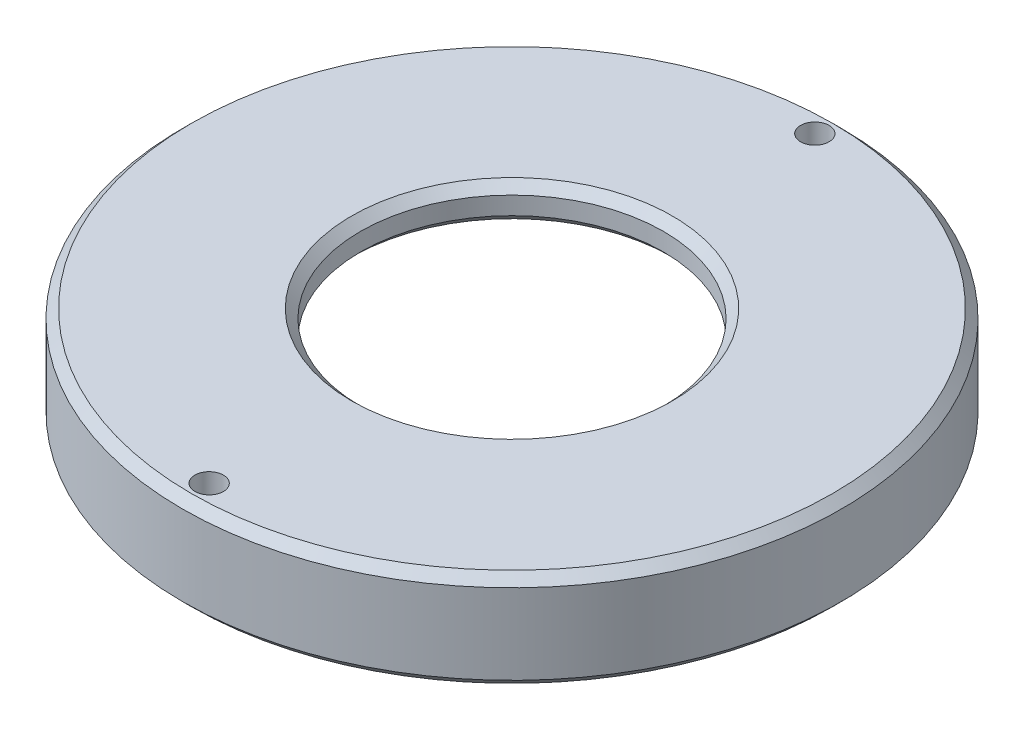
ISO-10303-21;
HEADER;
FILE_DESCRIPTION(('STEP AP214'),'2;1');
FILE_NAME('part.step','',(''),(''),'','','');
FILE_SCHEMA(('AUTOMOTIVE_DESIGN { 1 0 10303 214 1 1 1 1 }'));
ENDSEC;
DATA;
#1=APPLICATION_CONTEXT('core data for automotive mechanical design processes');
#2=APPLICATION_PROTOCOL_DEFINITION('international standard','automotive_design',2000,#1);
#3=PRODUCT_CONTEXT('',#1,'mechanical');
#4=PRODUCT('Part','Part','',(#3));
#5=PRODUCT_RELATED_PRODUCT_CATEGORY('part','',(#4));
#6=PRODUCT_DEFINITION_FORMATION('','',#4);
#7=PRODUCT_DEFINITION_CONTEXT('part definition',#1,'design');
#8=PRODUCT_DEFINITION('design','',#6,#7);
#9=PRODUCT_DEFINITION_SHAPE('','',#8);
#10=(LENGTH_UNIT() NAMED_UNIT(*) SI_UNIT(.MILLI.,.METRE.));
#11=(NAMED_UNIT(*) PLANE_ANGLE_UNIT() SI_UNIT($,.RADIAN.));
#12=(NAMED_UNIT(*) SI_UNIT($,.STERADIAN.) SOLID_ANGLE_UNIT());
#13=UNCERTAINTY_MEASURE_WITH_UNIT(LENGTH_MEASURE(1.E-05),#10,'distance_accuracy_value','');
#14=(GEOMETRIC_REPRESENTATION_CONTEXT(3) GLOBAL_UNCERTAINTY_ASSIGNED_CONTEXT((#13)) GLOBAL_UNIT_ASSIGNED_CONTEXT((#10,
#11,#12)) REPRESENTATION_CONTEXT('',''));
#15=CARTESIAN_POINT('',(0.,0.,0.));
#16=DIRECTION('',(0.,0.,1.));
#17=DIRECTION('',(1.,0.,0.));
#18=AXIS2_PLACEMENT_3D('',#15,#16,#17);
#19=CARTESIAN_POINT('',(0.,0.,0.));
#20=DIRECTION('',(0.,-1.,0.));
#21=DIRECTION('',(0.,0.,-1.));
#22=AXIS2_PLACEMENT_3D('',#19,#20,#21);
#23=CYLINDRICAL_SURFACE('',#22,8.5);
#24=CARTESIAN_POINT('',(0.,1.5,0.));
#25=DIRECTION('',(0.,1.,0.));
#26=DIRECTION('',(0.,0.,1.));
#27=AXIS2_PLACEMENT_3D('',#24,#25,#26);
#28=CIRCLE('',#27,8.5);
#29=CARTESIAN_POINT('',(0.,1.5,8.5));
#30=VERTEX_POINT('',#29);
#31=EDGE_CURVE('E40',#30,#30,#28,.T.);
#32=ORIENTED_EDGE('',*,*,#31,.T.);
#33=EDGE_LOOP('',(#32));
#34=FACE_BOUND('',#33,.T.);
#35=CARTESIAN_POINT('',(0.,0.500000000000007,0.));
#36=DIRECTION('',(0.,-1.,0.));
#37=DIRECTION('',(0.,0.,-1.));
#38=AXIS2_PLACEMENT_3D('',#35,#36,#37);
#39=CIRCLE('',#38,8.5);
#40=CARTESIAN_POINT('',(0.,0.500000000000007,-8.5));
#41=VERTEX_POINT('',#40);
#42=EDGE_CURVE('E44',#41,#41,#39,.T.);
#43=ORIENTED_EDGE('',*,*,#42,.T.);
#44=EDGE_LOOP('',(#43));
#45=FACE_BOUND('',#44,.T.);
#46=ADVANCED_FACE('F29',(#34,#45),#23,.F.);
#47=CARTESIAN_POINT('',(8.5,2.,0.));
#48=DIRECTION('',(0.,1.,0.));
#49=DIRECTION('',(0.,0.,1.));
#50=AXIS2_PLACEMENT_3D('',#47,#48,#49);
#51=PLANE('',#50);
#52=CARTESIAN_POINT('',(0.,2.,17.));
#53=DIRECTION('',(0.,1.,0.));
#54=DIRECTION('',(0.,0.,1.));
#55=AXIS2_PLACEMENT_3D('',#52,#53,#54);
#56=CIRCLE('',#55,0.799999999999998);
#57=CARTESIAN_POINT('',(0.,2.,17.8));
#58=VERTEX_POINT('',#57);
#59=EDGE_CURVE('E79',#58,#58,#56,.T.);
#60=ORIENTED_EDGE('',*,*,#59,.F.);
#61=EDGE_LOOP('',(#60));
#62=FACE_BOUND('',#61,.T.);
#63=CARTESIAN_POINT('',(0.,2.,-17.));
#64=DIRECTION('',(0.,1.,0.));
#65=DIRECTION('',(0.,0.,1.));
#66=AXIS2_PLACEMENT_3D('',#63,#64,#65);
#67=CIRCLE('',#66,0.799999999999998);
#68=CARTESIAN_POINT('',(0.,2.,-16.2));
#69=VERTEX_POINT('',#68);
#70=EDGE_CURVE('E73',#69,#69,#67,.T.);
#71=ORIENTED_EDGE('',*,*,#70,.F.);
#72=EDGE_LOOP('',(#71));
#73=FACE_BOUND('',#72,.T.);
#74=CARTESIAN_POINT('',(0.,2.,0.));
#75=DIRECTION('',(0.,1.,0.));
#76=DIRECTION('',(0.,0.,1.));
#77=AXIS2_PLACEMENT_3D('',#74,#75,#76);
#78=CIRCLE('',#77,9.);
#79=CARTESIAN_POINT('',(0.,2.,9.));
#80=VERTEX_POINT('',#79);
#81=EDGE_CURVE('E49',#80,#80,#78,.F.);
#82=ORIENTED_EDGE('',*,*,#81,.T.);
#83=EDGE_LOOP('',(#82));
#84=FACE_BOUND('',#83,.T.);
#85=CARTESIAN_POINT('',(0.,2.,0.));
#86=DIRECTION('',(0.,1.,0.));
#87=DIRECTION('',(0.,0.,1.));
#88=AXIS2_PLACEMENT_3D('',#85,#86,#87);
#89=CIRCLE('',#88,18.);
#90=CARTESIAN_POINT('',(0.,2.,18.));
#91=VERTEX_POINT('',#90);
#92=EDGE_CURVE('E52',#91,#91,#89,.T.);
#93=ORIENTED_EDGE('',*,*,#92,.T.);
#94=EDGE_LOOP('',(#93));
#95=FACE_BOUND('',#94,.T.);
#96=ADVANCED_FACE('F127',(#62,#73,#84,#95),#51,.T.);
#97=CARTESIAN_POINT('',(0.,0.,0.));
#98=DIRECTION('',(0.,-1.,0.));
#99=DIRECTION('',(0.,0.,-1.));
#100=AXIS2_PLACEMENT_3D('',#97,#98,#99);
#101=CYLINDRICAL_SURFACE('',#100,18.5);
#102=CARTESIAN_POINT('',(0.,-3.00000000000001,0.));
#103=DIRECTION('',(0.,-1.,0.));
#104=DIRECTION('',(0.,0.,-1.));
#105=AXIS2_PLACEMENT_3D('',#102,#103,#104);
#106=CIRCLE('',#105,18.5);
#107=CARTESIAN_POINT('',(0.,-3.00000000000001,-18.5));
#108=VERTEX_POINT('',#107);
#109=EDGE_CURVE('E61',#108,#108,#106,.F.);
#110=ORIENTED_EDGE('',*,*,#109,.T.);
#111=EDGE_LOOP('',(#110));
#112=FACE_BOUND('',#111,.T.);
#113=CARTESIAN_POINT('',(0.,1.49999999999999,0.));
#114=DIRECTION('',(0.,1.,0.));
#115=DIRECTION('',(0.,0.,1.));
#116=AXIS2_PLACEMENT_3D('',#113,#114,#115);
#117=CIRCLE('',#116,18.5);
#118=CARTESIAN_POINT('',(0.,1.49999999999999,18.5));
#119=VERTEX_POINT('',#118);
#120=EDGE_CURVE('E64',#119,#119,#117,.F.);
#121=ORIENTED_EDGE('',*,*,#120,.T.);
#122=EDGE_LOOP('',(#121));
#123=FACE_BOUND('',#122,.T.);
#124=ADVANCED_FACE('F92',(#112,#123),#101,.T.);
#125=CARTESIAN_POINT('',(15.5,-3.5,0.));
#126=DIRECTION('',(0.,-1.,0.));
#127=DIRECTION('',(0.,0.,-1.));
#128=AXIS2_PLACEMENT_3D('',#125,#126,#127);
#129=PLANE('',#128);
#130=CARTESIAN_POINT('',(0.,-3.5,17.));
#131=DIRECTION('',(0.,-1.,0.));
#132=DIRECTION('',(0.,0.,-1.));
#133=AXIS2_PLACEMENT_3D('',#130,#131,#132);
#134=CIRCLE('',#133,0.799999999999999);
#135=CARTESIAN_POINT('',(0.,-3.5,16.2));
#136=VERTEX_POINT('',#135);
#137=EDGE_CURVE('E82',#136,#136,#134,.T.);
#138=ORIENTED_EDGE('',*,*,#137,.F.);
#139=EDGE_LOOP('',(#138));
#140=FACE_BOUND('',#139,.T.);
#141=CARTESIAN_POINT('',(0.,-3.5,-17.));
#142=DIRECTION('',(0.,-1.,0.));
#143=DIRECTION('',(0.,0.,-1.));
#144=AXIS2_PLACEMENT_3D('',#141,#142,#143);
#145=CIRCLE('',#144,0.799999999999999);
#146=CARTESIAN_POINT('',(0.,-3.5,-17.8));
#147=VERTEX_POINT('',#146);
#148=EDGE_CURVE('E76',#147,#147,#145,.T.);
#149=ORIENTED_EDGE('',*,*,#148,.F.);
#150=EDGE_LOOP('',(#149));
#151=FACE_BOUND('',#150,.T.);
#152=CARTESIAN_POINT('',(0.,-3.5,0.));
#153=DIRECTION('',(0.,-1.,0.));
#154=DIRECTION('',(0.,0.,-1.));
#155=AXIS2_PLACEMENT_3D('',#152,#153,#154);
#156=CIRCLE('',#155,18.);
#157=CARTESIAN_POINT('',(0.,-3.5,-18.));
#158=VERTEX_POINT('',#157);
#159=EDGE_CURVE('E67',#158,#158,#156,.T.);
#160=ORIENTED_EDGE('',*,*,#159,.T.);
#161=EDGE_LOOP('',(#160));
#162=FACE_BOUND('',#161,.T.);
#163=CARTESIAN_POINT('',(0.,-3.5,0.));
#164=DIRECTION('',(0.,-1.,0.));
#165=DIRECTION('',(0.,0.,-1.));
#166=AXIS2_PLACEMENT_3D('',#163,#164,#165);
#167=CIRCLE('',#166,16.);
#168=CARTESIAN_POINT('',(0.,-3.5,-16.));
#169=VERTEX_POINT('',#168);
#170=EDGE_CURVE('E70',#169,#169,#167,.F.);
#171=ORIENTED_EDGE('',*,*,#170,.T.);
#172=EDGE_LOOP('',(#171));
#173=FACE_BOUND('',#172,.T.);
#174=ADVANCED_FACE('F88',(#140,#151,#162,#173),#129,.T.);
#175=CARTESIAN_POINT('',(0.,0.,0.));
#176=DIRECTION('',(0.,-1.,0.));
#177=DIRECTION('',(0.,0.,-1.));
#178=AXIS2_PLACEMENT_3D('',#175,#176,#177);
#179=CYLINDRICAL_SURFACE('',#178,15.5);
#180=CARTESIAN_POINT('',(0.,-3.,0.));
#181=DIRECTION('',(0.,-1.,0.));
#182=DIRECTION('',(0.,0.,-1.));
#183=AXIS2_PLACEMENT_3D('',#180,#181,#182);
#184=CIRCLE('',#183,15.5);
#185=CARTESIAN_POINT('',(0.,-3.,-15.5));
#186=VERTEX_POINT('',#185);
#187=EDGE_CURVE('E55',#186,#186,#184,.T.);
#188=ORIENTED_EDGE('',*,*,#187,.T.);
#189=EDGE_LOOP('',(#188));
#190=FACE_BOUND('',#189,.T.);
#191=CARTESIAN_POINT('',(0.,-0.500000000000004,0.));
#192=DIRECTION('',(0.,-1.,0.));
#193=DIRECTION('',(0.,0.,-1.));
#194=AXIS2_PLACEMENT_3D('',#191,#192,#193);
#195=CIRCLE('',#194,15.5);
#196=CARTESIAN_POINT('',(0.,-0.500000000000004,-15.5));
#197=VERTEX_POINT('',#196);
#198=EDGE_CURVE('E58',#197,#197,#195,.F.);
#199=ORIENTED_EDGE('',*,*,#198,.T.);
#200=EDGE_LOOP('',(#199));
#201=FACE_BOUND('',#200,.T.);
#202=ADVANCED_FACE('F91',(#190,#201),#179,.F.);
#203=CARTESIAN_POINT('',(8.5,0.,0.));
#204=DIRECTION('',(0.,-1.,0.));
#205=DIRECTION('',(0.,0.,-1.));
#206=AXIS2_PLACEMENT_3D('',#203,#204,#205);
#207=PLANE('',#206);
#208=CARTESIAN_POINT('',(0.,0.,0.));
#209=DIRECTION('',(0.,-1.,0.));
#210=DIRECTION('',(0.,0.,-1.));
#211=AXIS2_PLACEMENT_3D('',#208,#209,#210);
#212=CIRCLE('',#211,9.00000000000001);
#213=CARTESIAN_POINT('',(0.,0.,-9.00000000000001));
#214=VERTEX_POINT('',#213);
#215=EDGE_CURVE('E10',#214,#214,#212,.F.);
#216=ORIENTED_EDGE('',*,*,#215,.T.);
#217=EDGE_LOOP('',(#216));
#218=FACE_BOUND('',#217,.T.);
#219=CARTESIAN_POINT('',(0.,0.,0.));
#220=DIRECTION('',(0.,-1.,0.));
#221=DIRECTION('',(0.,0.,-1.));
#222=AXIS2_PLACEMENT_3D('',#219,#220,#221);
#223=CIRCLE('',#222,15.);
#224=CARTESIAN_POINT('',(0.,0.,-15.));
#225=VERTEX_POINT('',#224);
#226=EDGE_CURVE('E36',#225,#225,#223,.T.);
#227=ORIENTED_EDGE('',*,*,#226,.T.);
#228=EDGE_LOOP('',(#227));
#229=FACE_BOUND('',#228,.T.);
#230=ADVANCED_FACE('F110',(#218,#229),#207,.T.);
#231=CARTESIAN_POINT('',(0.,-3.5,0.));
#232=DIRECTION('',(0.,1.,0.));
#233=DIRECTION('',(0.,0.,1.));
#234=AXIS2_PLACEMENT_3D('',#231,#232,#233);
#235=CONICAL_SURFACE('',#234,18.,0.785398163397448);
#236=ORIENTED_EDGE('',*,*,#109,.F.);
#237=EDGE_LOOP('',(#236));
#238=FACE_BOUND('',#237,.T.);
#239=ORIENTED_EDGE('',*,*,#159,.F.);
#240=EDGE_LOOP('',(#239));
#241=FACE_BOUND('',#240,.T.);
#242=ADVANCED_FACE('F104',(#238,#241),#235,.T.);
#243=CARTESIAN_POINT('',(0.,-3.,0.));
#244=DIRECTION('',(0.,-1.,0.));
#245=DIRECTION('',(0.,0.,-1.));
#246=AXIS2_PLACEMENT_3D('',#243,#244,#245);
#247=CONICAL_SURFACE('',#246,15.5,0.785398163397447);
#248=ORIENTED_EDGE('',*,*,#170,.F.);
#249=EDGE_LOOP('',(#248));
#250=FACE_BOUND('',#249,.T.);
#251=ORIENTED_EDGE('',*,*,#187,.F.);
#252=EDGE_LOOP('',(#251));
#253=FACE_BOUND('',#252,.T.);
#254=ADVANCED_FACE('F100',(#250,#253),#247,.F.);
#255=CARTESIAN_POINT('',(0.,2.,0.));
#256=DIRECTION('',(0.,1.,0.));
#257=DIRECTION('',(0.,0.,1.));
#258=AXIS2_PLACEMENT_3D('',#255,#256,#257);
#259=CONICAL_SURFACE('',#258,9.,0.785398163397445);
#260=ORIENTED_EDGE('',*,*,#31,.F.);
#261=EDGE_LOOP('',(#260));
#262=FACE_BOUND('',#261,.T.);
#263=ORIENTED_EDGE('',*,*,#81,.F.);
#264=EDGE_LOOP('',(#263));
#265=FACE_BOUND('',#264,.T.);
#266=ADVANCED_FACE('F103',(#262,#265),#259,.F.);
#267=CARTESIAN_POINT('',(0.,0.500000000000007,0.));
#268=DIRECTION('',(0.,-1.,0.));
#269=DIRECTION('',(0.,0.,-1.));
#270=AXIS2_PLACEMENT_3D('',#267,#268,#269);
#271=CONICAL_SURFACE('',#270,8.5,0.785398163397448);
#272=ORIENTED_EDGE('',*,*,#215,.F.);
#273=EDGE_LOOP('',(#272));
#274=FACE_BOUND('',#273,.T.);
#275=ORIENTED_EDGE('',*,*,#42,.F.);
#276=EDGE_LOOP('',(#275));
#277=FACE_BOUND('',#276,.T.);
#278=ADVANCED_FACE('F117',(#274,#277),#271,.F.);
#279=CARTESIAN_POINT('',(0.,0.,0.));
#280=DIRECTION('',(0.,-1.,0.));
#281=DIRECTION('',(0.,0.,-1.));
#282=AXIS2_PLACEMENT_3D('',#279,#280,#281);
#283=CONICAL_SURFACE('',#282,15.,0.785398163397452);
#284=ORIENTED_EDGE('',*,*,#198,.F.);
#285=EDGE_LOOP('',(#284));
#286=FACE_BOUND('',#285,.T.);
#287=ORIENTED_EDGE('',*,*,#226,.F.);
#288=EDGE_LOOP('',(#287));
#289=FACE_BOUND('',#288,.T.);
#290=ADVANCED_FACE('F114',(#286,#289),#283,.F.);
#291=CARTESIAN_POINT('',(0.,1.49999999999999,0.));
#292=DIRECTION('',(0.,-1.,0.));
#293=DIRECTION('',(0.,0.,-1.));
#294=AXIS2_PLACEMENT_3D('',#291,#292,#293);
#295=CONICAL_SURFACE('',#294,18.5,0.785398163397448);
#296=ORIENTED_EDGE('',*,*,#92,.F.);
#297=EDGE_LOOP('',(#296));
#298=FACE_BOUND('',#297,.T.);
#299=ORIENTED_EDGE('',*,*,#120,.F.);
#300=EDGE_LOOP('',(#299));
#301=FACE_BOUND('',#300,.T.);
#302=ADVANCED_FACE('F31',(#298,#301),#295,.T.);
#303=CARTESIAN_POINT('',(0.,-3.5,-17.));
#304=DIRECTION('',(0.,-1.,0.));
#305=DIRECTION('',(0.,0.,-1.));
#306=AXIS2_PLACEMENT_3D('',#303,#304,#305);
#307=CYLINDRICAL_SURFACE('',#306,0.799999999999998);
#308=ORIENTED_EDGE('',*,*,#70,.T.);
#309=EDGE_LOOP('',(#308));
#310=FACE_BOUND('',#309,.T.);
#311=ORIENTED_EDGE('',*,*,#148,.T.);
#312=EDGE_LOOP('',(#311));
#313=FACE_BOUND('',#312,.T.);
#314=ADVANCED_FACE('F122',(#310,#313),#307,.F.);
#315=CARTESIAN_POINT('',(0.,-3.5,17.));
#316=DIRECTION('',(0.,-1.,0.));
#317=DIRECTION('',(0.,0.,-1.));
#318=AXIS2_PLACEMENT_3D('',#315,#316,#317);
#319=CYLINDRICAL_SURFACE('',#318,0.799999999999998);
#320=ORIENTED_EDGE('',*,*,#59,.T.);
#321=EDGE_LOOP('',(#320));
#322=FACE_BOUND('',#321,.T.);
#323=ORIENTED_EDGE('',*,*,#137,.T.);
#324=EDGE_LOOP('',(#323));
#325=FACE_BOUND('',#324,.T.);
#326=ADVANCED_FACE('F86',(#322,#325),#319,.F.);
#327=CLOSED_SHELL('',(#46,#96,#124,#174,#202,#230,#242,#254,#266,#278,#290,#302,#314,#326));
#328=MANIFOLD_SOLID_BREP('B2',#327);
#329=ADVANCED_BREP_SHAPE_REPRESENTATION('',(#18,#328),#14);
#330=SHAPE_DEFINITION_REPRESENTATION(#9,#329);
ENDSEC;
END-ISO-10303-21;
